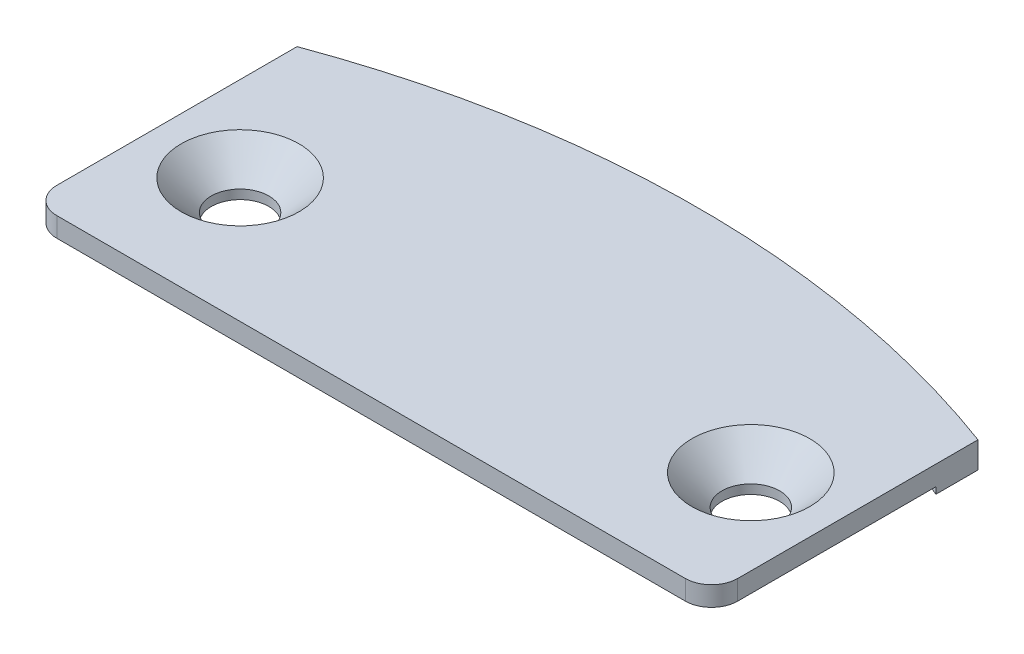
ISO-10303-21;
HEADER;
FILE_DESCRIPTION(('STEP AP214'),'2;1');
FILE_NAME('part.step','',(''),(''),'','','');
FILE_SCHEMA(('AUTOMOTIVE_DESIGN { 1 0 10303 214 1 1 1 1 }'));
ENDSEC;
DATA;
#1=APPLICATION_CONTEXT('core data for automotive mechanical design processes');
#2=APPLICATION_PROTOCOL_DEFINITION('international standard','automotive_design',2000,#1);
#3=PRODUCT_CONTEXT('',#1,'mechanical');
#4=PRODUCT('Part','Part','',(#3));
#5=PRODUCT_RELATED_PRODUCT_CATEGORY('part','',(#4));
#6=PRODUCT_DEFINITION_FORMATION('','',#4);
#7=PRODUCT_DEFINITION_CONTEXT('part definition',#1,'design');
#8=PRODUCT_DEFINITION('design','',#6,#7);
#9=PRODUCT_DEFINITION_SHAPE('','',#8);
#10=(LENGTH_UNIT() NAMED_UNIT(*) SI_UNIT(.MILLI.,.METRE.));
#11=(NAMED_UNIT(*) PLANE_ANGLE_UNIT() SI_UNIT($,.RADIAN.));
#12=(NAMED_UNIT(*) SI_UNIT($,.STERADIAN.) SOLID_ANGLE_UNIT());
#13=UNCERTAINTY_MEASURE_WITH_UNIT(LENGTH_MEASURE(1.E-05),#10,'distance_accuracy_value','');
#14=(GEOMETRIC_REPRESENTATION_CONTEXT(3) GLOBAL_UNCERTAINTY_ASSIGNED_CONTEXT((#13)) GLOBAL_UNIT_ASSIGNED_CONTEXT((#10,
#11,#12)) REPRESENTATION_CONTEXT('',''));
#15=CARTESIAN_POINT('',(0.,0.,0.));
#16=DIRECTION('',(0.,0.,1.));
#17=DIRECTION('',(1.,0.,0.));
#18=AXIS2_PLACEMENT_3D('',#15,#16,#17);
#19=CARTESIAN_POINT('',(13.,1.5,-25.));
#20=DIRECTION('',(-1.,0.,0.));
#21=DIRECTION('',(0.,0.,1.));
#22=AXIS2_PLACEMENT_3D('',#19,#20,#21);
#23=PLANE('',#22);
#24=DIRECTION('',(0.,0.,1.));
#25=VECTOR('',#24,1.);
#26=CARTESIAN_POINT('',(13.,0.5,-25.));
#27=LINE('',#26,#25);
#28=CARTESIAN_POINT('',(13.,0.5,-33.5708206630945));
#29=VERTEX_POINT('',#28);
#30=CARTESIAN_POINT('',(13.,0.5,-35.1745646739616));
#31=VERTEX_POINT('',#30);
#32=EDGE_CURVE('E211',#29,#31,#27,.F.);
#33=ORIENTED_EDGE('',*,*,#32,.T.);
#34=DIRECTION('',(0.,1.,0.));
#35=VECTOR('',#34,1.);
#36=CARTESIAN_POINT('',(13.,1.5,-35.174564674));
#37=LINE('',#36,#35);
#38=CARTESIAN_POINT('',(13.,1.5,-35.1745646739616));
#39=VERTEX_POINT('',#38);
#40=EDGE_CURVE('E182',#31,#39,#37,.T.);
#41=ORIENTED_EDGE('',*,*,#40,.T.);
#42=DIRECTION('',(0.,0.,1.));
#43=VECTOR('',#42,1.);
#44=CARTESIAN_POINT('',(13.,1.5,0.));
#45=LINE('',#44,#43);
#46=CARTESIAN_POINT('',(13.,1.5,-26.));
#47=VERTEX_POINT('',#46);
#48=EDGE_CURVE('E185',#47,#39,#45,.F.);
#49=ORIENTED_EDGE('',*,*,#48,.F.);
#50=DIRECTION('',(0.,1.,0.));
#51=VECTOR('',#50,1.);
#52=CARTESIAN_POINT('',(13.,1.125,-26.));
#53=LINE('',#52,#51);
#54=CARTESIAN_POINT('',(13.,0.75,-26.));
#55=VERTEX_POINT('',#54);
#56=EDGE_CURVE('E172',#55,#47,#53,.T.);
#57=ORIENTED_EDGE('',*,*,#56,.F.);
#58=DIRECTION('',(0.,0.,-1.));
#59=VECTOR('',#58,1.);
#60=CARTESIAN_POINT('',(13.,0.75,0.));
#61=LINE('',#60,#59);
#62=CARTESIAN_POINT('',(13.,0.75,-33.5708206630945));
#63=VERTEX_POINT('',#62);
#64=EDGE_CURVE('E305',#63,#55,#61,.F.);
#65=ORIENTED_EDGE('',*,*,#64,.F.);
#66=DIRECTION('',(0.,1.,0.));
#67=VECTOR('',#66,1.);
#68=CARTESIAN_POINT('',(13.,1.5,-33.570820663));
#69=LINE('',#68,#67);
#70=EDGE_CURVE('E208',#63,#29,#69,.F.);
#71=ORIENTED_EDGE('',*,*,#70,.T.);
#72=EDGE_LOOP('',(#33,#41,#49,#57,#65,#71));
#73=FACE_BOUND('',#72,.T.);
#74=ADVANCED_FACE('F16',(#73),#23,.F.);
#75=CARTESIAN_POINT('',(12.,0.75,-26.));
#76=DIRECTION('',(0.,-1.,0.));
#77=DIRECTION('',(1.,0.,0.));
#78=AXIS2_PLACEMENT_3D('',#75,#76,#77);
#79=CYLINDRICAL_SURFACE('',#78,0.999999999999997);
#80=CARTESIAN_POINT('',(12.,0.75,-26.));
#81=DIRECTION('',(0.,-1.,0.));
#82=DIRECTION('',(1.,0.,0.));
#83=AXIS2_PLACEMENT_3D('',#80,#81,#82);
#84=CIRCLE('',#83,0.999999999999997);
#85=CARTESIAN_POINT('',(12.,0.75,-25.));
#86=VERTEX_POINT('',#85);
#87=EDGE_CURVE('E178',#55,#86,#84,.T.);
#88=ORIENTED_EDGE('',*,*,#87,.F.);
#89=ORIENTED_EDGE('',*,*,#56,.T.);
#90=CARTESIAN_POINT('',(12.,1.5,-26.));
#91=DIRECTION('',(0.,-1.,0.));
#92=DIRECTION('',(1.,0.,0.));
#93=AXIS2_PLACEMENT_3D('',#90,#91,#92);
#94=CIRCLE('',#93,0.999999999999997);
#95=CARTESIAN_POINT('',(12.,1.5,-25.));
#96=VERTEX_POINT('',#95);
#97=EDGE_CURVE('E19',#96,#47,#94,.F.);
#98=ORIENTED_EDGE('',*,*,#97,.F.);
#99=DIRECTION('',(0.,1.,0.));
#100=VECTOR('',#99,1.);
#101=CARTESIAN_POINT('',(12.,1.5,-25.));
#102=LINE('',#101,#100);
#103=EDGE_CURVE('E167',#86,#96,#102,.T.);
#104=ORIENTED_EDGE('',*,*,#103,.F.);
#105=EDGE_LOOP('',(#88,#89,#98,#104));
#106=FACE_BOUND('',#105,.T.);
#107=ADVANCED_FACE('F174',(#106),#79,.T.);
#108=CARTESIAN_POINT('',(-13.,1.5,-25.));
#109=DIRECTION('',(0.,0.,-1.));
#110=DIRECTION('',(-1.,0.,0.));
#111=AXIS2_PLACEMENT_3D('',#108,#109,#110);
#112=PLANE('',#111);
#113=DIRECTION('',(1.,0.,0.));
#114=VECTOR('',#113,1.);
#115=CARTESIAN_POINT('',(0.,1.5,-25.));
#116=LINE('',#115,#114);
#117=CARTESIAN_POINT('',(-12.,1.5,-25.));
#118=VERTEX_POINT('',#117);
#119=EDGE_CURVE('E194',#118,#96,#116,.T.);
#120=ORIENTED_EDGE('',*,*,#119,.F.);
#121=DIRECTION('',(0.,1.,0.));
#122=VECTOR('',#121,1.);
#123=CARTESIAN_POINT('',(-12.,1.125,-25.));
#124=LINE('',#123,#122);
#125=CARTESIAN_POINT('',(-12.,0.75,-25.));
#126=VERTEX_POINT('',#125);
#127=EDGE_CURVE('E203',#126,#118,#124,.T.);
#128=ORIENTED_EDGE('',*,*,#127,.F.);
#129=DIRECTION('',(1.,0.,0.));
#130=VECTOR('',#129,1.);
#131=CARTESIAN_POINT('',(0.,0.75,-25.));
#132=LINE('',#131,#130);
#133=EDGE_CURVE('E304',#86,#126,#132,.F.);
#134=ORIENTED_EDGE('',*,*,#133,.F.);
#135=ORIENTED_EDGE('',*,*,#103,.T.);
#136=EDGE_LOOP('',(#120,#128,#134,#135));
#137=FACE_BOUND('',#136,.T.);
#138=ADVANCED_FACE('F666',(#137),#112,.F.);
#139=CARTESIAN_POINT('',(-12.,0.75,-26.));
#140=DIRECTION('',(0.,-1.,0.));
#141=DIRECTION('',(1.,0.,0.));
#142=AXIS2_PLACEMENT_3D('',#139,#140,#141);
#143=CYLINDRICAL_SURFACE('',#142,0.999999999999997);
#144=CARTESIAN_POINT('',(-12.,0.75,-26.));
#145=DIRECTION('',(0.,-1.,0.));
#146=DIRECTION('',(1.,0.,0.));
#147=AXIS2_PLACEMENT_3D('',#144,#145,#146);
#148=CIRCLE('',#147,0.999999999999997);
#149=CARTESIAN_POINT('',(-13.,0.75,-26.));
#150=VERTEX_POINT('',#149);
#151=EDGE_CURVE('E301',#126,#150,#148,.T.);
#152=ORIENTED_EDGE('',*,*,#151,.F.);
#153=ORIENTED_EDGE('',*,*,#127,.T.);
#154=CARTESIAN_POINT('',(-12.,1.5,-26.));
#155=DIRECTION('',(0.,-1.,0.));
#156=DIRECTION('',(1.,0.,0.));
#157=AXIS2_PLACEMENT_3D('',#154,#155,#156);
#158=CIRCLE('',#157,0.999999999999997);
#159=CARTESIAN_POINT('',(-13.,1.5,-26.));
#160=VERTEX_POINT('',#159);
#161=EDGE_CURVE('E306',#160,#118,#158,.F.);
#162=ORIENTED_EDGE('',*,*,#161,.F.);
#163=DIRECTION('',(0.,1.,0.));
#164=VECTOR('',#163,1.);
#165=CARTESIAN_POINT('',(-13.,1.5,-26.));
#166=LINE('',#165,#164);
#167=EDGE_CURVE('E201',#150,#160,#166,.T.);
#168=ORIENTED_EDGE('',*,*,#167,.F.);
#169=EDGE_LOOP('',(#152,#153,#162,#168));
#170=FACE_BOUND('',#169,.T.);
#171=ADVANCED_FACE('F657',(#170),#143,.T.);
#172=CARTESIAN_POINT('',(-13.,1.5,-35.174564674));
#173=DIRECTION('',(1.,0.,0.));
#174=DIRECTION('',(0.,0.,-1.));
#175=AXIS2_PLACEMENT_3D('',#172,#173,#174);
#176=PLANE('',#175);
#177=DIRECTION('',(0.,0.,-1.));
#178=VECTOR('',#177,1.);
#179=CARTESIAN_POINT('',(-13.,0.5,-35.174564674));
#180=LINE('',#179,#178);
#181=CARTESIAN_POINT('',(-13.,0.5,-35.1745646739616));
#182=VERTEX_POINT('',#181);
#183=CARTESIAN_POINT('',(-13.,0.5,-33.5708206630945));
#184=VERTEX_POINT('',#183);
#185=EDGE_CURVE('E197',#182,#184,#180,.F.);
#186=ORIENTED_EDGE('',*,*,#185,.T.);
#187=DIRECTION('',(0.,1.,0.));
#188=VECTOR('',#187,1.);
#189=CARTESIAN_POINT('',(-13.,1.5,-33.570820663));
#190=LINE('',#189,#188);
#191=CARTESIAN_POINT('',(-13.,0.75,-33.5708206630945));
#192=VERTEX_POINT('',#191);
#193=EDGE_CURVE('E195',#184,#192,#190,.T.);
#194=ORIENTED_EDGE('',*,*,#193,.T.);
#195=DIRECTION('',(0.,0.,-1.));
#196=VECTOR('',#195,1.);
#197=CARTESIAN_POINT('',(-13.,0.75,0.));
#198=LINE('',#197,#196);
#199=EDGE_CURVE('E300',#150,#192,#198,.T.);
#200=ORIENTED_EDGE('',*,*,#199,.F.);
#201=ORIENTED_EDGE('',*,*,#167,.T.);
#202=DIRECTION('',(0.,0.,1.));
#203=VECTOR('',#202,1.);
#204=CARTESIAN_POINT('',(-13.,1.5,0.));
#205=LINE('',#204,#203);
#206=CARTESIAN_POINT('',(-13.,1.5,-35.1745646739616));
#207=VERTEX_POINT('',#206);
#208=EDGE_CURVE('E189',#207,#160,#205,.T.);
#209=ORIENTED_EDGE('',*,*,#208,.F.);
#210=DIRECTION('',(0.,1.,0.));
#211=VECTOR('',#210,1.);
#212=CARTESIAN_POINT('',(-13.,1.5,-35.174564674));
#213=LINE('',#212,#211);
#214=EDGE_CURVE('E202',#207,#182,#213,.F.);
#215=ORIENTED_EDGE('',*,*,#214,.T.);
#216=EDGE_LOOP('',(#186,#194,#200,#201,#209,#215));
#217=FACE_BOUND('',#216,.T.);
#218=ADVANCED_FACE('F648',(#217),#176,.F.);
#219=CARTESIAN_POINT('',(0.,1.5,0.));
#220=DIRECTION('',(0.,1.,0.));
#221=DIRECTION('',(0.,0.,1.));
#222=AXIS2_PLACEMENT_3D('',#219,#220,#221);
#223=PLANE('',#222);
#224=CARTESIAN_POINT('',(9.75,1.5,-29.75));
#225=DIRECTION('',(0.,1.,0.));
#226=DIRECTION('',(0.,0.,1.));
#227=AXIS2_PLACEMENT_3D('',#224,#225,#226);
#228=CIRCLE('',#227,2.25);
#229=CARTESIAN_POINT('',(9.75,1.5,-27.5));
#230=VERTEX_POINT('',#229);
#231=EDGE_CURVE('E297',#230,#230,#228,.T.);
#232=ORIENTED_EDGE('',*,*,#231,.F.);
#233=EDGE_LOOP('',(#232));
#234=FACE_BOUND('',#233,.T.);
#235=CARTESIAN_POINT('',(-9.75,1.5,-29.75));
#236=DIRECTION('',(0.,1.,0.));
#237=DIRECTION('',(0.,0.,1.));
#238=AXIS2_PLACEMENT_3D('',#235,#236,#237);
#239=CIRCLE('',#238,2.25);
#240=CARTESIAN_POINT('',(-9.75,1.5,-27.5));
#241=VERTEX_POINT('',#240);
#242=EDGE_CURVE('E294',#241,#241,#239,.T.);
#243=ORIENTED_EDGE('',*,*,#242,.F.);
#244=EDGE_LOOP('',(#243));
#245=FACE_BOUND('',#244,.T.);
#246=ORIENTED_EDGE('',*,*,#208,.T.);
#247=ORIENTED_EDGE('',*,*,#161,.T.);
#248=ORIENTED_EDGE('',*,*,#119,.T.);
#249=ORIENTED_EDGE('',*,*,#97,.T.);
#250=ORIENTED_EDGE('',*,*,#48,.T.);
#251=CARTESIAN_POINT('',(0.,1.5,0.));
#252=DIRECTION('',(0.,-1.,0.));
#253=DIRECTION('',(0.,0.,-1.));
#254=AXIS2_PLACEMENT_3D('',#251,#252,#253);
#255=CIRCLE('',#254,37.5);
#256=EDGE_CURVE('E289',#207,#39,#255,.T.);
#257=ORIENTED_EDGE('',*,*,#256,.F.);
#258=EDGE_LOOP('',(#246,#247,#248,#249,#250,#257));
#259=FACE_BOUND('',#258,.T.);
#260=ADVANCED_FACE('F192',(#234,#245,#259),#223,.T.);
#261=CARTESIAN_POINT('',(0.,0.75,0.));
#262=DIRECTION('',(0.,-1.,0.));
#263=DIRECTION('',(0.,0.,-1.));
#264=AXIS2_PLACEMENT_3D('',#261,#262,#263);
#265=PLANE('',#264);
#266=DIRECTION('',(0.,0.,1.));
#267=VECTOR('',#266,1.);
#268=CARTESIAN_POINT('',(-7.5,0.75,-19.761303674));
#269=LINE('',#268,#267);
#270=CARTESIAN_POINT('',(-7.5,0.75,-27.5));
#271=VERTEX_POINT('',#270);
#272=CARTESIAN_POINT('',(-7.5,0.75,-27.));
#273=VERTEX_POINT('',#272);
#274=EDGE_CURVE('E317',#271,#273,#269,.T.);
#275=ORIENTED_EDGE('',*,*,#274,.F.);
#276=CARTESIAN_POINT('',(-7.,0.75,-27.5));
#277=DIRECTION('',(0.,1.,0.));
#278=DIRECTION('',(0.,0.,1.));
#279=AXIS2_PLACEMENT_3D('',#276,#277,#278);
#280=CIRCLE('',#279,0.5);
#281=CARTESIAN_POINT('',(-7.,0.75,-28.));
#282=VERTEX_POINT('',#281);
#283=EDGE_CURVE('E273',#282,#271,#280,.T.);
#284=ORIENTED_EDGE('',*,*,#283,.F.);
#285=DIRECTION('',(-1.,0.,0.));
#286=VECTOR('',#285,1.);
#287=CARTESIAN_POINT('',(-7.5,0.75,-28.));
#288=LINE('',#287,#286);
#289=CARTESIAN_POINT('',(7.,0.75,-28.));
#290=VERTEX_POINT('',#289);
#291=EDGE_CURVE('E277',#290,#282,#288,.T.);
#292=ORIENTED_EDGE('',*,*,#291,.F.);
#293=CARTESIAN_POINT('',(7.,0.75,-27.5));
#294=DIRECTION('',(0.,1.,0.));
#295=DIRECTION('',(0.,0.,1.));
#296=AXIS2_PLACEMENT_3D('',#293,#294,#295);
#297=CIRCLE('',#296,0.5);
#298=CARTESIAN_POINT('',(7.5,0.75,-27.5));
#299=VERTEX_POINT('',#298);
#300=EDGE_CURVE('E278',#299,#290,#297,.T.);
#301=ORIENTED_EDGE('',*,*,#300,.F.);
#302=DIRECTION('',(0.,0.,-1.));
#303=VECTOR('',#302,1.);
#304=CARTESIAN_POINT('',(7.5,0.75,-19.761303674));
#305=LINE('',#304,#303);
#306=CARTESIAN_POINT('',(7.5,0.75,-27.));
#307=VERTEX_POINT('',#306);
#308=EDGE_CURVE('E281',#307,#299,#305,.T.);
#309=ORIENTED_EDGE('',*,*,#308,.F.);
#310=CARTESIAN_POINT('',(8.,0.75,-27.));
#311=DIRECTION('',(0.,-1.,0.));
#312=DIRECTION('',(0.,0.,-1.));
#313=AXIS2_PLACEMENT_3D('',#310,#311,#312);
#314=CIRCLE('',#313,0.5);
#315=CARTESIAN_POINT('',(8.,0.75,-26.5));
#316=VERTEX_POINT('',#315);
#317=EDGE_CURVE('E282',#316,#307,#314,.T.);
#318=ORIENTED_EDGE('',*,*,#317,.F.);
#319=DIRECTION('',(-1.,0.,0.));
#320=VECTOR('',#319,1.);
#321=CARTESIAN_POINT('',(0.,0.75,-26.5));
#322=LINE('',#321,#320);
#323=CARTESIAN_POINT('',(10.,0.75,-26.5));
#324=VERTEX_POINT('',#323);
#325=EDGE_CURVE('E285',#324,#316,#322,.T.);
#326=ORIENTED_EDGE('',*,*,#325,.F.);
#327=CARTESIAN_POINT('',(10.,0.75,-28.));
#328=DIRECTION('',(0.,-1.,0.));
#329=DIRECTION('',(0.,0.,-1.));
#330=AXIS2_PLACEMENT_3D('',#327,#328,#329);
#331=CIRCLE('',#330,1.5);
#332=CARTESIAN_POINT('',(11.5,0.75,-28.));
#333=VERTEX_POINT('',#332);
#334=EDGE_CURVE('E260',#333,#324,#331,.T.);
#335=ORIENTED_EDGE('',*,*,#334,.F.);
#336=DIRECTION('',(0.,0.,1.));
#337=VECTOR('',#336,1.);
#338=CARTESIAN_POINT('',(11.5,0.75,0.));
#339=LINE('',#338,#337);
#340=CARTESIAN_POINT('',(11.5,0.75,-34.1137802069157));
#341=VERTEX_POINT('',#340);
#342=EDGE_CURVE('E337',#341,#333,#339,.T.);
#343=ORIENTED_EDGE('',*,*,#342,.F.);
#344=CARTESIAN_POINT('',(0.,0.75,0.));
#345=DIRECTION('',(0.,-1.,0.));
#346=DIRECTION('',(1.,0.,0.));
#347=AXIS2_PLACEMENT_3D('',#344,#345,#346);
#348=CIRCLE('',#347,36.);
#349=EDGE_CURVE('E286',#63,#341,#348,.F.);
#350=ORIENTED_EDGE('',*,*,#349,.F.);
#351=ORIENTED_EDGE('',*,*,#64,.T.);
#352=ORIENTED_EDGE('',*,*,#87,.T.);
#353=ORIENTED_EDGE('',*,*,#133,.T.);
#354=ORIENTED_EDGE('',*,*,#151,.T.);
#355=ORIENTED_EDGE('',*,*,#199,.T.);
#356=CARTESIAN_POINT('',(0.,0.75,0.));
#357=DIRECTION('',(0.,-1.,0.));
#358=DIRECTION('',(1.,0.,0.));
#359=AXIS2_PLACEMENT_3D('',#356,#357,#358);
#360=CIRCLE('',#359,36.);
#361=CARTESIAN_POINT('',(-11.5,0.75,-34.1137802069157));
#362=VERTEX_POINT('',#361);
#363=EDGE_CURVE('E291',#362,#192,#360,.F.);
#364=ORIENTED_EDGE('',*,*,#363,.F.);
#365=DIRECTION('',(0.,0.,1.));
#366=VECTOR('',#365,1.);
#367=CARTESIAN_POINT('',(-11.5,0.75,0.));
#368=LINE('',#367,#366);
#369=CARTESIAN_POINT('',(-11.5,0.75,-28.));
#370=VERTEX_POINT('',#369);
#371=EDGE_CURVE('E322',#370,#362,#368,.F.);
#372=ORIENTED_EDGE('',*,*,#371,.F.);
#373=CARTESIAN_POINT('',(-10.,0.75,-28.));
#374=DIRECTION('',(0.,1.,0.));
#375=DIRECTION('',(-1.,0.,0.));
#376=AXIS2_PLACEMENT_3D('',#373,#374,#375);
#377=CIRCLE('',#376,1.5);
#378=CARTESIAN_POINT('',(-10.,0.75,-26.5));
#379=VERTEX_POINT('',#378);
#380=EDGE_CURVE('E265',#379,#370,#377,.F.);
#381=ORIENTED_EDGE('',*,*,#380,.F.);
#382=DIRECTION('',(-1.,0.,0.));
#383=VECTOR('',#382,1.);
#384=CARTESIAN_POINT('',(0.,0.75,-26.5));
#385=LINE('',#384,#383);
#386=CARTESIAN_POINT('',(-8.,0.75,-26.5));
#387=VERTEX_POINT('',#386);
#388=EDGE_CURVE('E268',#387,#379,#385,.T.);
#389=ORIENTED_EDGE('',*,*,#388,.F.);
#390=CARTESIAN_POINT('',(-8.,0.75,-27.));
#391=DIRECTION('',(0.,1.,0.));
#392=DIRECTION('',(-1.,0.,0.));
#393=AXIS2_PLACEMENT_3D('',#390,#391,#392);
#394=CIRCLE('',#393,0.5);
#395=EDGE_CURVE('E269',#273,#387,#394,.F.);
#396=ORIENTED_EDGE('',*,*,#395,.F.);
#397=EDGE_LOOP('',(#275,#284,#292,#301,#309,#318,#326,#335,#343,#350,#351,#352,#353,#354,#355,
#364,#372,#381,#389,#396));
#398=FACE_BOUND('',#397,.T.);
#399=ADVANCED_FACE('F441',(#398),#265,.T.);
#400=CARTESIAN_POINT('',(9.75,0.35,-29.75));
#401=DIRECTION('',(0.,1.,0.));
#402=DIRECTION('',(0.,0.,1.));
#403=AXIS2_PLACEMENT_3D('',#400,#401,#402);
#404=CONICAL_SURFACE('',#403,1.1,0.785398163397449);
#405=ORIENTED_EDGE('',*,*,#231,.T.);
#406=EDGE_LOOP('',(#405));
#407=FACE_BOUND('',#406,.T.);
#408=CARTESIAN_POINT('',(9.75,0.35,-29.75));
#409=DIRECTION('',(0.,1.,0.));
#410=DIRECTION('',(0.,0.,1.));
#411=AXIS2_PLACEMENT_3D('',#408,#409,#410);
#412=CIRCLE('',#411,1.1);
#413=CARTESIAN_POINT('',(9.75,0.35,-28.65));
#414=VERTEX_POINT('',#413);
#415=EDGE_CURVE('E340',#414,#414,#412,.T.);
#416=ORIENTED_EDGE('',*,*,#415,.F.);
#417=EDGE_LOOP('',(#416));
#418=FACE_BOUND('',#417,.T.);
#419=ADVANCED_FACE('F624',(#407,#418),#404,.F.);
#420=CARTESIAN_POINT('',(-9.75,0.35,-29.75));
#421=DIRECTION('',(0.,1.,0.));
#422=DIRECTION('',(0.,0.,1.));
#423=AXIS2_PLACEMENT_3D('',#420,#421,#422);
#424=CONICAL_SURFACE('',#423,1.1,0.785398163397449);
#425=ORIENTED_EDGE('',*,*,#242,.T.);
#426=EDGE_LOOP('',(#425));
#427=FACE_BOUND('',#426,.T.);
#428=CARTESIAN_POINT('',(-9.75,0.35,-29.75));
#429=DIRECTION('',(0.,1.,0.));
#430=DIRECTION('',(0.,0.,1.));
#431=AXIS2_PLACEMENT_3D('',#428,#429,#430);
#432=CIRCLE('',#431,1.1);
#433=CARTESIAN_POINT('',(-9.75,0.35,-28.65));
#434=VERTEX_POINT('',#433);
#435=EDGE_CURVE('E259',#434,#434,#432,.T.);
#436=ORIENTED_EDGE('',*,*,#435,.F.);
#437=EDGE_LOOP('',(#436));
#438=FACE_BOUND('',#437,.T.);
#439=ADVANCED_FACE('F615',(#427,#438),#424,.F.);
#440=CARTESIAN_POINT('',(0.,0.75,0.));
#441=DIRECTION('',(0.,-1.,0.));
#442=DIRECTION('',(1.,0.,0.));
#443=AXIS2_PLACEMENT_3D('',#440,#441,#442);
#444=CYLINDRICAL_SURFACE('',#443,36.);
#445=ORIENTED_EDGE('',*,*,#363,.T.);
#446=ORIENTED_EDGE('',*,*,#193,.F.);
#447=CARTESIAN_POINT('',(0.,0.5,0.));
#448=DIRECTION('',(0.,-1.,0.));
#449=DIRECTION('',(1.,0.,0.));
#450=AXIS2_PLACEMENT_3D('',#447,#448,#449);
#451=CIRCLE('',#450,36.);
#452=CARTESIAN_POINT('',(-11.4999999999745,0.5,-34.1137802069243));
#453=VERTEX_POINT('',#452);
#454=EDGE_CURVE('E256',#453,#184,#451,.F.);
#455=ORIENTED_EDGE('',*,*,#454,.F.);
#456=DIRECTION('',(0.,1.,0.));
#457=VECTOR('',#456,1.);
#458=CARTESIAN_POINT('',(-11.5,0.75,-34.113780207));
#459=LINE('',#458,#457);
#460=EDGE_CURVE('E325',#362,#453,#459,.F.);
#461=ORIENTED_EDGE('',*,*,#460,.F.);
#462=EDGE_LOOP('',(#445,#446,#455,#461));
#463=FACE_BOUND('',#462,.T.);
#464=ADVANCED_FACE('F606',(#463),#444,.F.);
#465=CARTESIAN_POINT('',(0.,0.5,0.));
#466=DIRECTION('',(0.,-1.,0.));
#467=DIRECTION('',(0.,0.,-1.));
#468=AXIS2_PLACEMENT_3D('',#465,#466,#467);
#469=CYLINDRICAL_SURFACE('',#468,37.5);
#470=ORIENTED_EDGE('',*,*,#40,.F.);
#471=CARTESIAN_POINT('',(0.,0.5,0.));
#472=DIRECTION('',(0.,-1.,0.));
#473=DIRECTION('',(0.,0.,-1.));
#474=AXIS2_PLACEMENT_3D('',#471,#472,#473);
#475=CIRCLE('',#474,37.5);
#476=EDGE_CURVE('E253',#182,#31,#475,.T.);
#477=ORIENTED_EDGE('',*,*,#476,.F.);
#478=ORIENTED_EDGE('',*,*,#214,.F.);
#479=ORIENTED_EDGE('',*,*,#256,.T.);
#480=EDGE_LOOP('',(#470,#477,#478,#479));
#481=FACE_BOUND('',#480,.T.);
#482=ADVANCED_FACE('F598',(#481),#469,.T.);
#483=CARTESIAN_POINT('',(0.,0.75,0.));
#484=DIRECTION('',(0.,-1.,0.));
#485=DIRECTION('',(1.,0.,0.));
#486=AXIS2_PLACEMENT_3D('',#483,#484,#485);
#487=CYLINDRICAL_SURFACE('',#486,36.);
#488=ORIENTED_EDGE('',*,*,#349,.T.);
#489=DIRECTION('',(0.,1.,0.));
#490=VECTOR('',#489,1.);
#491=CARTESIAN_POINT('',(11.5,0.75,-34.113780207));
#492=LINE('',#491,#490);
#493=CARTESIAN_POINT('',(11.4999999999745,0.5,-34.1137802069243));
#494=VERTEX_POINT('',#493);
#495=EDGE_CURVE('E264',#494,#341,#492,.T.);
#496=ORIENTED_EDGE('',*,*,#495,.F.);
#497=CARTESIAN_POINT('',(0.,0.5,0.));
#498=DIRECTION('',(0.,-1.,0.));
#499=DIRECTION('',(1.,0.,0.));
#500=AXIS2_PLACEMENT_3D('',#497,#498,#499);
#501=CIRCLE('',#500,36.);
#502=EDGE_CURVE('E250',#29,#494,#501,.F.);
#503=ORIENTED_EDGE('',*,*,#502,.F.);
#504=ORIENTED_EDGE('',*,*,#70,.F.);
#505=EDGE_LOOP('',(#488,#496,#503,#504));
#506=FACE_BOUND('',#505,.T.);
#507=ADVANCED_FACE('F436',(#506),#487,.F.);
#508=CARTESIAN_POINT('',(0.,0.75,-26.5));
#509=DIRECTION('',(0.,0.,-1.));
#510=DIRECTION('',(-1.,0.,0.));
#511=AXIS2_PLACEMENT_3D('',#508,#509,#510);
#512=PLANE('',#511);
#513=DIRECTION('',(1.,0.,0.));
#514=VECTOR('',#513,1.);
#515=CARTESIAN_POINT('',(0.,0.,-26.5));
#516=LINE('',#515,#514);
#517=CARTESIAN_POINT('',(10.,0.,-26.5));
#518=VERTEX_POINT('',#517);
#519=CARTESIAN_POINT('',(8.,0.,-26.5));
#520=VERTEX_POINT('',#519);
#521=EDGE_CURVE('E249',#518,#520,#516,.F.);
#522=ORIENTED_EDGE('',*,*,#521,.F.);
#523=DIRECTION('',(0.,-1.,0.));
#524=VECTOR('',#523,1.);
#525=CARTESIAN_POINT('',(10.,0.375,-26.5));
#526=LINE('',#525,#524);
#527=EDGE_CURVE('E263',#324,#518,#526,.T.);
#528=ORIENTED_EDGE('',*,*,#527,.F.);
#529=ORIENTED_EDGE('',*,*,#325,.T.);
#530=DIRECTION('',(0.,1.,0.));
#531=VECTOR('',#530,1.);
#532=CARTESIAN_POINT('',(8.,0.375,-26.5));
#533=LINE('',#532,#531);
#534=EDGE_CURVE('E284',#520,#316,#533,.T.);
#535=ORIENTED_EDGE('',*,*,#534,.F.);
#536=EDGE_LOOP('',(#522,#528,#529,#535));
#537=FACE_BOUND('',#536,.T.);
#538=ADVANCED_FACE('F396',(#537),#512,.F.);
#539=CARTESIAN_POINT('',(8.,0.,-27.));
#540=DIRECTION('',(0.,-1.,0.));
#541=DIRECTION('',(0.,0.,-1.));
#542=AXIS2_PLACEMENT_3D('',#539,#540,#541);
#543=CYLINDRICAL_SURFACE('',#542,0.5);
#544=CARTESIAN_POINT('',(8.,0.,-27.));
#545=DIRECTION('',(0.,-1.,0.));
#546=DIRECTION('',(0.,0.,-1.));
#547=AXIS2_PLACEMENT_3D('',#544,#545,#546);
#548=CIRCLE('',#547,0.5);
#549=CARTESIAN_POINT('',(7.5,0.,-27.));
#550=VERTEX_POINT('',#549);
#551=EDGE_CURVE('E246',#520,#550,#548,.T.);
#552=ORIENTED_EDGE('',*,*,#551,.F.);
#553=ORIENTED_EDGE('',*,*,#534,.T.);
#554=ORIENTED_EDGE('',*,*,#317,.T.);
#555=DIRECTION('',(0.,1.,0.));
#556=VECTOR('',#555,1.);
#557=CARTESIAN_POINT('',(7.5,0.75,-27.));
#558=LINE('',#557,#556);
#559=EDGE_CURVE('E313',#550,#307,#558,.T.);
#560=ORIENTED_EDGE('',*,*,#559,.F.);
#561=EDGE_LOOP('',(#552,#553,#554,#560));
#562=FACE_BOUND('',#561,.T.);
#563=ADVANCED_FACE('F400',(#562),#543,.T.);
#564=CARTESIAN_POINT('',(7.5,0.75,-19.761303674));
#565=DIRECTION('',(1.,0.,0.));
#566=DIRECTION('',(0.,0.,-1.));
#567=AXIS2_PLACEMENT_3D('',#564,#565,#566);
#568=PLANE('',#567);
#569=ORIENTED_EDGE('',*,*,#308,.T.);
#570=DIRECTION('',(0.,1.,0.));
#571=VECTOR('',#570,1.);
#572=CARTESIAN_POINT('',(7.5,0.375,-27.5));
#573=LINE('',#572,#571);
#574=CARTESIAN_POINT('',(7.5,0.,-27.5));
#575=VERTEX_POINT('',#574);
#576=EDGE_CURVE('E280',#575,#299,#573,.T.);
#577=ORIENTED_EDGE('',*,*,#576,.F.);
#578=DIRECTION('',(0.,0.,1.));
#579=VECTOR('',#578,1.);
#580=CARTESIAN_POINT('',(7.5,0.,0.));
#581=LINE('',#580,#579);
#582=EDGE_CURVE('E245',#550,#575,#581,.F.);
#583=ORIENTED_EDGE('',*,*,#582,.F.);
#584=ORIENTED_EDGE('',*,*,#559,.T.);
#585=EDGE_LOOP('',(#569,#577,#583,#584));
#586=FACE_BOUND('',#585,.T.);
#587=ADVANCED_FACE('F403',(#586),#568,.F.);
#588=CARTESIAN_POINT('',(7.,0.,-27.5));
#589=DIRECTION('',(0.,1.,0.));
#590=DIRECTION('',(0.,0.,1.));
#591=AXIS2_PLACEMENT_3D('',#588,#589,#590);
#592=CYLINDRICAL_SURFACE('',#591,0.5);
#593=CARTESIAN_POINT('',(7.,0.,-27.5));
#594=DIRECTION('',(0.,1.,0.));
#595=DIRECTION('',(0.,0.,1.));
#596=AXIS2_PLACEMENT_3D('',#593,#594,#595);
#597=CIRCLE('',#596,0.5);
#598=CARTESIAN_POINT('',(7.,0.,-28.));
#599=VERTEX_POINT('',#598);
#600=EDGE_CURVE('E242',#575,#599,#597,.T.);
#601=ORIENTED_EDGE('',*,*,#600,.F.);
#602=ORIENTED_EDGE('',*,*,#576,.T.);
#603=ORIENTED_EDGE('',*,*,#300,.T.);
#604=DIRECTION('',(0.,1.,0.));
#605=VECTOR('',#604,1.);
#606=CARTESIAN_POINT('',(7.,0.75,-28.));
#607=LINE('',#606,#605);
#608=EDGE_CURVE('E316',#599,#290,#607,.T.);
#609=ORIENTED_EDGE('',*,*,#608,.F.);
#610=EDGE_LOOP('',(#601,#602,#603,#609));
#611=FACE_BOUND('',#610,.T.);
#612=ADVANCED_FACE('F406',(#611),#592,.F.);
#613=CARTESIAN_POINT('',(-7.5,0.75,-28.));
#614=DIRECTION('',(0.,0.,-1.));
#615=DIRECTION('',(-1.,0.,0.));
#616=AXIS2_PLACEMENT_3D('',#613,#614,#615);
#617=PLANE('',#616);
#618=ORIENTED_EDGE('',*,*,#291,.T.);
#619=DIRECTION('',(0.,1.,0.));
#620=VECTOR('',#619,1.);
#621=CARTESIAN_POINT('',(-7.,0.375,-28.));
#622=LINE('',#621,#620);
#623=CARTESIAN_POINT('',(-7.,0.,-28.));
#624=VERTEX_POINT('',#623);
#625=EDGE_CURVE('E276',#624,#282,#622,.T.);
#626=ORIENTED_EDGE('',*,*,#625,.F.);
#627=DIRECTION('',(1.,0.,0.));
#628=VECTOR('',#627,1.);
#629=CARTESIAN_POINT('',(0.,0.,-28.));
#630=LINE('',#629,#628);
#631=EDGE_CURVE('E241',#599,#624,#630,.F.);
#632=ORIENTED_EDGE('',*,*,#631,.F.);
#633=ORIENTED_EDGE('',*,*,#608,.T.);
#634=EDGE_LOOP('',(#618,#626,#632,#633));
#635=FACE_BOUND('',#634,.T.);
#636=ADVANCED_FACE('F410',(#635),#617,.F.);
#637=CARTESIAN_POINT('',(-7.,0.,-27.5));
#638=DIRECTION('',(0.,1.,0.));
#639=DIRECTION('',(0.,0.,1.));
#640=AXIS2_PLACEMENT_3D('',#637,#638,#639);
#641=CYLINDRICAL_SURFACE('',#640,0.5);
#642=CARTESIAN_POINT('',(-7.,0.,-27.5));
#643=DIRECTION('',(0.,1.,0.));
#644=DIRECTION('',(0.,0.,1.));
#645=AXIS2_PLACEMENT_3D('',#642,#643,#644);
#646=CIRCLE('',#645,0.5);
#647=CARTESIAN_POINT('',(-7.5,0.,-27.5));
#648=VERTEX_POINT('',#647);
#649=EDGE_CURVE('E238',#624,#648,#646,.T.);
#650=ORIENTED_EDGE('',*,*,#649,.F.);
#651=ORIENTED_EDGE('',*,*,#625,.T.);
#652=ORIENTED_EDGE('',*,*,#283,.T.);
#653=DIRECTION('',(0.,1.,0.));
#654=VECTOR('',#653,1.);
#655=CARTESIAN_POINT('',(-7.5,0.75,-27.5));
#656=LINE('',#655,#654);
#657=EDGE_CURVE('E319',#648,#271,#656,.T.);
#658=ORIENTED_EDGE('',*,*,#657,.F.);
#659=EDGE_LOOP('',(#650,#651,#652,#658));
#660=FACE_BOUND('',#659,.T.);
#661=ADVANCED_FACE('F413',(#660),#641,.F.);
#662=CARTESIAN_POINT('',(-7.5,0.75,-19.761303674));
#663=DIRECTION('',(-1.,0.,0.));
#664=DIRECTION('',(0.,0.,1.));
#665=AXIS2_PLACEMENT_3D('',#662,#663,#664);
#666=PLANE('',#665);
#667=DIRECTION('',(0.,0.,1.));
#668=VECTOR('',#667,1.);
#669=CARTESIAN_POINT('',(-7.5,0.,0.));
#670=LINE('',#669,#668);
#671=CARTESIAN_POINT('',(-7.5,0.,-27.));
#672=VERTEX_POINT('',#671);
#673=EDGE_CURVE('E237',#648,#672,#670,.T.);
#674=ORIENTED_EDGE('',*,*,#673,.F.);
#675=ORIENTED_EDGE('',*,*,#657,.T.);
#676=ORIENTED_EDGE('',*,*,#274,.T.);
#677=DIRECTION('',(0.,1.,0.));
#678=VECTOR('',#677,1.);
#679=CARTESIAN_POINT('',(-7.5,0.375,-27.));
#680=LINE('',#679,#678);
#681=EDGE_CURVE('E272',#672,#273,#680,.T.);
#682=ORIENTED_EDGE('',*,*,#681,.F.);
#683=EDGE_LOOP('',(#674,#675,#676,#682));
#684=FACE_BOUND('',#683,.T.);
#685=ADVANCED_FACE('F416',(#684),#666,.F.);
#686=CARTESIAN_POINT('',(-8.,0.75,-27.));
#687=DIRECTION('',(0.,1.,0.));
#688=DIRECTION('',(-1.,0.,0.));
#689=AXIS2_PLACEMENT_3D('',#686,#687,#688);
#690=CYLINDRICAL_SURFACE('',#689,0.5);
#691=ORIENTED_EDGE('',*,*,#395,.T.);
#692=DIRECTION('',(0.,1.,0.));
#693=VECTOR('',#692,1.);
#694=CARTESIAN_POINT('',(-8.,0.75,-26.5));
#695=LINE('',#694,#693);
#696=CARTESIAN_POINT('',(-8.,0.,-26.5));
#697=VERTEX_POINT('',#696);
#698=EDGE_CURVE('E271',#697,#387,#695,.T.);
#699=ORIENTED_EDGE('',*,*,#698,.F.);
#700=CARTESIAN_POINT('',(-8.,0.,-27.));
#701=DIRECTION('',(0.,1.,0.));
#702=DIRECTION('',(-1.,0.,0.));
#703=AXIS2_PLACEMENT_3D('',#700,#701,#702);
#704=CIRCLE('',#703,0.5);
#705=EDGE_CURVE('E234',#672,#697,#704,.F.);
#706=ORIENTED_EDGE('',*,*,#705,.F.);
#707=ORIENTED_EDGE('',*,*,#681,.T.);
#708=EDGE_LOOP('',(#691,#699,#706,#707));
#709=FACE_BOUND('',#708,.T.);
#710=ADVANCED_FACE('F420',(#709),#690,.T.);
#711=CARTESIAN_POINT('',(0.,0.75,-26.5));
#712=DIRECTION('',(0.,0.,-1.));
#713=DIRECTION('',(-1.,0.,0.));
#714=AXIS2_PLACEMENT_3D('',#711,#712,#713);
#715=PLANE('',#714);
#716=ORIENTED_EDGE('',*,*,#388,.T.);
#717=DIRECTION('',(0.,1.,0.));
#718=VECTOR('',#717,1.);
#719=CARTESIAN_POINT('',(-10.,0.375,-26.5));
#720=LINE('',#719,#718);
#721=CARTESIAN_POINT('',(-10.,0.,-26.5));
#722=VERTEX_POINT('',#721);
#723=EDGE_CURVE('E267',#722,#379,#720,.T.);
#724=ORIENTED_EDGE('',*,*,#723,.F.);
#725=DIRECTION('',(1.,0.,0.));
#726=VECTOR('',#725,1.);
#727=CARTESIAN_POINT('',(0.,0.,-26.5));
#728=LINE('',#727,#726);
#729=EDGE_CURVE('E233',#697,#722,#728,.F.);
#730=ORIENTED_EDGE('',*,*,#729,.F.);
#731=ORIENTED_EDGE('',*,*,#698,.T.);
#732=EDGE_LOOP('',(#716,#724,#730,#731));
#733=FACE_BOUND('',#732,.T.);
#734=ADVANCED_FACE('F424',(#733),#715,.F.);
#735=CARTESIAN_POINT('',(-10.,0.75,-28.));
#736=DIRECTION('',(0.,1.,0.));
#737=DIRECTION('',(-1.,0.,0.));
#738=AXIS2_PLACEMENT_3D('',#735,#736,#737);
#739=CYLINDRICAL_SURFACE('',#738,1.5);
#740=CARTESIAN_POINT('',(-10.,0.,-28.));
#741=DIRECTION('',(0.,1.,0.));
#742=DIRECTION('',(-1.,0.,0.));
#743=AXIS2_PLACEMENT_3D('',#740,#741,#742);
#744=CIRCLE('',#743,1.5);
#745=CARTESIAN_POINT('',(-11.5,0.,-28.));
#746=VERTEX_POINT('',#745);
#747=EDGE_CURVE('E229',#722,#746,#744,.F.);
#748=ORIENTED_EDGE('',*,*,#747,.F.);
#749=ORIENTED_EDGE('',*,*,#723,.T.);
#750=ORIENTED_EDGE('',*,*,#380,.T.);
#751=DIRECTION('',(0.,1.,0.));
#752=VECTOR('',#751,1.);
#753=CARTESIAN_POINT('',(-11.5,0.75,-28.));
#754=LINE('',#753,#752);
#755=EDGE_CURVE('E326',#746,#370,#754,.T.);
#756=ORIENTED_EDGE('',*,*,#755,.F.);
#757=EDGE_LOOP('',(#748,#749,#750,#756));
#758=FACE_BOUND('',#757,.T.);
#759=ADVANCED_FACE('F427',(#758),#739,.T.);
#760=CARTESIAN_POINT('',(-11.5,0.75,0.));
#761=DIRECTION('',(-1.,0.,0.));
#762=DIRECTION('',(0.,0.,1.));
#763=AXIS2_PLACEMENT_3D('',#760,#761,#762);
#764=PLANE('',#763);
#765=ORIENTED_EDGE('',*,*,#460,.T.);
#766=DIRECTION('',(0.,1.,0.));
#767=VECTOR('',#766,1.);
#768=CARTESIAN_POINT('',(-11.5,0.75,-34.113780207));
#769=LINE('',#768,#767);
#770=CARTESIAN_POINT('',(-11.5,0.,-34.1137802069157));
#771=VERTEX_POINT('',#770);
#772=EDGE_CURVE('E34',#453,#771,#769,.F.);
#773=ORIENTED_EDGE('',*,*,#772,.T.);
#774=DIRECTION('',(0.,0.,1.));
#775=VECTOR('',#774,1.);
#776=CARTESIAN_POINT('',(-11.5,0.,0.));
#777=LINE('',#776,#775);
#778=EDGE_CURVE('E232',#746,#771,#777,.F.);
#779=ORIENTED_EDGE('',*,*,#778,.F.);
#780=ORIENTED_EDGE('',*,*,#755,.T.);
#781=ORIENTED_EDGE('',*,*,#371,.T.);
#782=EDGE_LOOP('',(#765,#773,#779,#780,#781));
#783=FACE_BOUND('',#782,.T.);
#784=ADVANCED_FACE('F444',(#783),#764,.T.);
#785=CARTESIAN_POINT('',(11.5,0.75,0.));
#786=DIRECTION('',(-1.,0.,0.));
#787=DIRECTION('',(0.,0.,1.));
#788=AXIS2_PLACEMENT_3D('',#785,#786,#787);
#789=PLANE('',#788);
#790=DIRECTION('',(0.,1.,0.));
#791=VECTOR('',#790,1.);
#792=CARTESIAN_POINT('',(11.5,0.75,-34.113780207));
#793=LINE('',#792,#791);
#794=CARTESIAN_POINT('',(11.5,0.,-34.1137802069157));
#795=VERTEX_POINT('',#794);
#796=EDGE_CURVE('E329',#795,#494,#793,.T.);
#797=ORIENTED_EDGE('',*,*,#796,.T.);
#798=ORIENTED_EDGE('',*,*,#495,.T.);
#799=ORIENTED_EDGE('',*,*,#342,.T.);
#800=DIRECTION('',(0.,1.,0.));
#801=VECTOR('',#800,1.);
#802=CARTESIAN_POINT('',(11.5,0.375,-28.));
#803=LINE('',#802,#801);
#804=CARTESIAN_POINT('',(11.5,0.,-28.));
#805=VERTEX_POINT('',#804);
#806=EDGE_CURVE('E343',#805,#333,#803,.T.);
#807=ORIENTED_EDGE('',*,*,#806,.F.);
#808=DIRECTION('',(0.,0.,1.));
#809=VECTOR('',#808,1.);
#810=CARTESIAN_POINT('',(11.5,0.,0.));
#811=LINE('',#810,#809);
#812=EDGE_CURVE('E228',#795,#805,#811,.T.);
#813=ORIENTED_EDGE('',*,*,#812,.F.);
#814=EDGE_LOOP('',(#797,#798,#799,#807,#813));
#815=FACE_BOUND('',#814,.T.);
#816=ADVANCED_FACE('F391',(#815),#789,.F.);
#817=CARTESIAN_POINT('',(10.,0.,-28.));
#818=DIRECTION('',(0.,-1.,0.));
#819=DIRECTION('',(0.,0.,-1.));
#820=AXIS2_PLACEMENT_3D('',#817,#818,#819);
#821=CYLINDRICAL_SURFACE('',#820,1.5);
#822=CARTESIAN_POINT('',(10.,0.,-28.));
#823=DIRECTION('',(0.,-1.,0.));
#824=DIRECTION('',(0.,0.,-1.));
#825=AXIS2_PLACEMENT_3D('',#822,#823,#824);
#826=CIRCLE('',#825,1.5);
#827=EDGE_CURVE('E225',#805,#518,#826,.T.);
#828=ORIENTED_EDGE('',*,*,#827,.F.);
#829=ORIENTED_EDGE('',*,*,#806,.T.);
#830=ORIENTED_EDGE('',*,*,#334,.T.);
#831=ORIENTED_EDGE('',*,*,#527,.T.);
#832=EDGE_LOOP('',(#828,#829,#830,#831));
#833=FACE_BOUND('',#832,.T.);
#834=ADVANCED_FACE('F393',(#833),#821,.T.);
#835=CARTESIAN_POINT('',(9.75,0.,-29.75));
#836=DIRECTION('',(0.,1.,0.));
#837=DIRECTION('',(0.,0.,1.));
#838=AXIS2_PLACEMENT_3D('',#835,#836,#837);
#839=CYLINDRICAL_SURFACE('',#838,1.1);
#840=ORIENTED_EDGE('',*,*,#415,.T.);
#841=EDGE_LOOP('',(#840));
#842=FACE_BOUND('',#841,.T.);
#843=CARTESIAN_POINT('',(9.75,0.,-29.75));
#844=DIRECTION('',(0.,1.,0.));
#845=DIRECTION('',(0.,0.,1.));
#846=AXIS2_PLACEMENT_3D('',#843,#844,#845);
#847=CIRCLE('',#846,1.1);
#848=CARTESIAN_POINT('',(9.75,0.,-28.65));
#849=VERTEX_POINT('',#848);
#850=EDGE_CURVE('E222',#849,#849,#847,.T.);
#851=ORIENTED_EDGE('',*,*,#850,.F.);
#852=EDGE_LOOP('',(#851));
#853=FACE_BOUND('',#852,.T.);
#854=ADVANCED_FACE('F467',(#842,#853),#839,.F.);
#855=CARTESIAN_POINT('',(-9.75,0.,-29.75));
#856=DIRECTION('',(0.,1.,0.));
#857=DIRECTION('',(0.,0.,1.));
#858=AXIS2_PLACEMENT_3D('',#855,#856,#857);
#859=CYLINDRICAL_SURFACE('',#858,1.1);
#860=ORIENTED_EDGE('',*,*,#435,.T.);
#861=EDGE_LOOP('',(#860));
#862=FACE_BOUND('',#861,.T.);
#863=CARTESIAN_POINT('',(-9.75,0.,-29.75));
#864=DIRECTION('',(0.,1.,0.));
#865=DIRECTION('',(0.,0.,1.));
#866=AXIS2_PLACEMENT_3D('',#863,#864,#865);
#867=CIRCLE('',#866,1.1);
#868=CARTESIAN_POINT('',(-9.75,0.,-28.65));
#869=VERTEX_POINT('',#868);
#870=EDGE_CURVE('E219',#869,#869,#867,.T.);
#871=ORIENTED_EDGE('',*,*,#870,.F.);
#872=EDGE_LOOP('',(#871));
#873=FACE_BOUND('',#872,.T.);
#874=ADVANCED_FACE('F464',(#862,#873),#859,.F.);
#875=CARTESIAN_POINT('',(0.,0.5,0.));
#876=DIRECTION('',(0.,-1.,0.));
#877=DIRECTION('',(0.,0.,-1.));
#878=AXIS2_PLACEMENT_3D('',#875,#876,#877);
#879=PLANE('',#878);
#880=ORIENTED_EDGE('',*,*,#502,.T.);
#881=CARTESIAN_POINT('',(0.,0.5,0.));
#882=DIRECTION('',(0.,-1.,0.));
#883=DIRECTION('',(0.,0.,-1.));
#884=AXIS2_PLACEMENT_3D('',#881,#882,#883);
#885=CIRCLE('',#884,36.);
#886=EDGE_CURVE('E25',#453,#494,#885,.T.);
#887=ORIENTED_EDGE('',*,*,#886,.F.);
#888=ORIENTED_EDGE('',*,*,#454,.T.);
#889=ORIENTED_EDGE('',*,*,#185,.F.);
#890=ORIENTED_EDGE('',*,*,#476,.T.);
#891=ORIENTED_EDGE('',*,*,#32,.F.);
#892=EDGE_LOOP('',(#880,#887,#888,#889,#890,#891));
#893=FACE_BOUND('',#892,.T.);
#894=ADVANCED_FACE('F438',(#893),#879,.T.);
#895=CARTESIAN_POINT('',(0.,0.,0.));
#896=DIRECTION('',(0.,1.,0.));
#897=DIRECTION('',(0.,0.,1.));
#898=AXIS2_PLACEMENT_3D('',#895,#896,#897);
#899=PLANE('',#898);
#900=ORIENTED_EDGE('',*,*,#870,.T.);
#901=EDGE_LOOP('',(#900));
#902=FACE_BOUND('',#901,.T.);
#903=ORIENTED_EDGE('',*,*,#850,.T.);
#904=EDGE_LOOP('',(#903));
#905=FACE_BOUND('',#904,.T.);
#906=ORIENTED_EDGE('',*,*,#812,.T.);
#907=ORIENTED_EDGE('',*,*,#827,.T.);
#908=ORIENTED_EDGE('',*,*,#521,.T.);
#909=ORIENTED_EDGE('',*,*,#551,.T.);
#910=ORIENTED_EDGE('',*,*,#582,.T.);
#911=ORIENTED_EDGE('',*,*,#600,.T.);
#912=ORIENTED_EDGE('',*,*,#631,.T.);
#913=ORIENTED_EDGE('',*,*,#649,.T.);
#914=ORIENTED_EDGE('',*,*,#673,.T.);
#915=ORIENTED_EDGE('',*,*,#705,.T.);
#916=ORIENTED_EDGE('',*,*,#729,.T.);
#917=ORIENTED_EDGE('',*,*,#747,.T.);
#918=ORIENTED_EDGE('',*,*,#778,.T.);
#919=CARTESIAN_POINT('',(0.,0.,0.));
#920=DIRECTION('',(0.,-1.,0.));
#921=DIRECTION('',(0.,0.,-1.));
#922=AXIS2_PLACEMENT_3D('',#919,#920,#921);
#923=CIRCLE('',#922,36.);
#924=EDGE_CURVE('E11',#795,#771,#923,.F.);
#925=ORIENTED_EDGE('',*,*,#924,.F.);
#926=EDGE_LOOP('',(#906,#907,#908,#909,#910,#911,#912,#913,#914,#915,#916,#917,#918,#925));
#927=FACE_BOUND('',#926,.T.);
#928=ADVANCED_FACE('F387',(#902,#905,#927),#899,.F.);
#929=CARTESIAN_POINT('',(0.,0.,0.));
#930=DIRECTION('',(0.,-1.,0.));
#931=DIRECTION('',(0.,0.,-1.));
#932=AXIS2_PLACEMENT_3D('',#929,#930,#931);
#933=CYLINDRICAL_SURFACE('',#932,36.);
#934=ORIENTED_EDGE('',*,*,#924,.T.);
#935=ORIENTED_EDGE('',*,*,#772,.F.);
#936=ORIENTED_EDGE('',*,*,#886,.T.);
#937=ORIENTED_EDGE('',*,*,#796,.F.);
#938=EDGE_LOOP('',(#934,#935,#936,#937));
#939=FACE_BOUND('',#938,.T.);
#940=ADVANCED_FACE('F429',(#939),#933,.T.);
#941=CLOSED_SHELL('',(#74,#107,#138,#171,#218,#260,#399,#419,#439,#464,#482,#507,#538,#563,#587,
#612,#636,#661,#685,#710,#734,#759,#784,#816,#834,#854,#874,#894,#928,#940));
#942=MANIFOLD_SOLID_BREP('B1',#941);
#943=ADVANCED_BREP_SHAPE_REPRESENTATION('',(#18,#942),#14);
#944=SHAPE_DEFINITION_REPRESENTATION(#9,#943);
ENDSEC;
END-ISO-10303-21;
